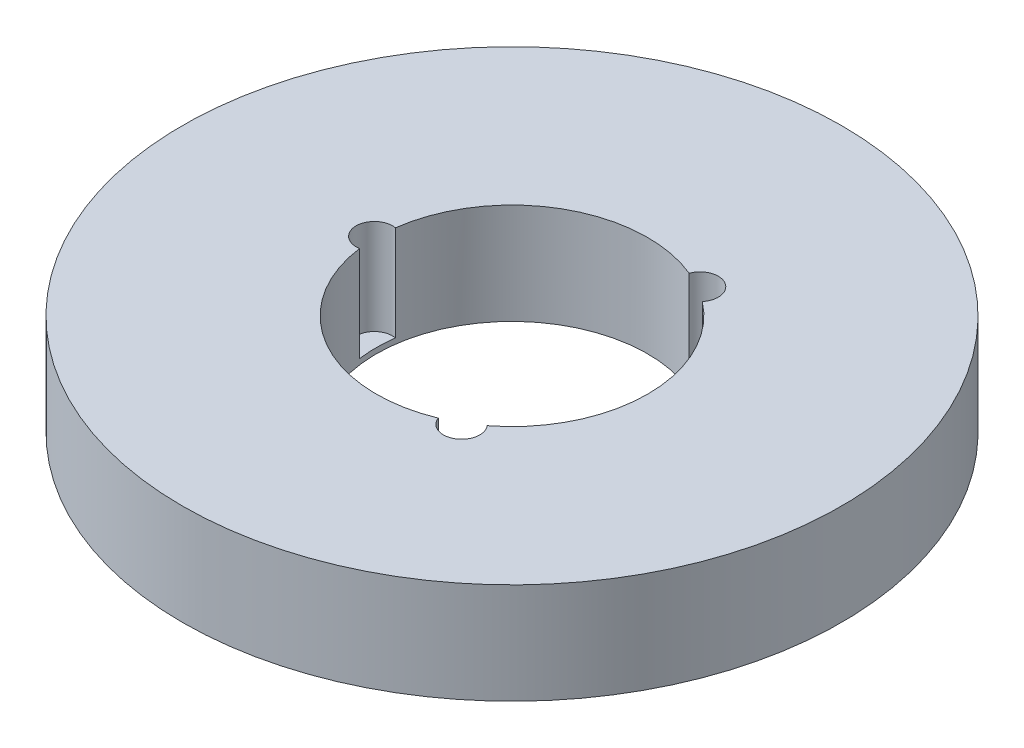
ISO-10303-21;
HEADER;
FILE_DESCRIPTION(('STEP AP214'),'2;1');
FILE_NAME('part.step','',(''),(''),'','','');
FILE_SCHEMA(('AUTOMOTIVE_DESIGN { 1 0 10303 214 1 1 1 1 }'));
ENDSEC;
DATA;
#1=APPLICATION_CONTEXT('core data for automotive mechanical design processes');
#2=APPLICATION_PROTOCOL_DEFINITION('international standard','automotive_design',2000,#1);
#3=PRODUCT_CONTEXT('',#1,'mechanical');
#4=PRODUCT('Part','Part','',(#3));
#5=PRODUCT_RELATED_PRODUCT_CATEGORY('part','',(#4));
#6=PRODUCT_DEFINITION_FORMATION('','',#4);
#7=PRODUCT_DEFINITION_CONTEXT('part definition',#1,'design');
#8=PRODUCT_DEFINITION('design','',#6,#7);
#9=PRODUCT_DEFINITION_SHAPE('','',#8);
#10=(LENGTH_UNIT() NAMED_UNIT(*) SI_UNIT(.MILLI.,.METRE.));
#11=(NAMED_UNIT(*) PLANE_ANGLE_UNIT() SI_UNIT($,.RADIAN.));
#12=(NAMED_UNIT(*) SI_UNIT($,.STERADIAN.) SOLID_ANGLE_UNIT());
#13=UNCERTAINTY_MEASURE_WITH_UNIT(LENGTH_MEASURE(1.E-05),#10,'distance_accuracy_value','');
#14=(GEOMETRIC_REPRESENTATION_CONTEXT(3) GLOBAL_UNCERTAINTY_ASSIGNED_CONTEXT((#13)) GLOBAL_UNIT_ASSIGNED_CONTEXT((#10,
#11,#12)) REPRESENTATION_CONTEXT('',''));
#15=CARTESIAN_POINT('',(0.,0.,0.));
#16=DIRECTION('',(0.,0.,1.));
#17=DIRECTION('',(1.,0.,0.));
#18=AXIS2_PLACEMENT_3D('',#15,#16,#17);
#19=CARTESIAN_POINT('',(0.,26.,0.));
#20=DIRECTION('',(0.,-1.,0.));
#21=DIRECTION('',(0.,0.,-1.));
#22=AXIS2_PLACEMENT_3D('',#19,#20,#21);
#23=CYLINDRICAL_SURFACE('',#22,85.);
#24=CARTESIAN_POINT('',(0.,26.,0.));
#25=DIRECTION('',(0.,1.,0.));
#26=DIRECTION('',(0.,0.,1.));
#27=AXIS2_PLACEMENT_3D('',#24,#25,#26);
#28=CIRCLE('',#27,85.);
#29=CARTESIAN_POINT('',(0.,26.,-85.));
#30=VERTEX_POINT('',#29);
#31=EDGE_CURVE('E126',#30,#30,#28,.T.);
#32=CARTESIAN_POINT('',(0.,0.,0.));
#33=DIRECTION('',(0.,1.,0.));
#34=DIRECTION('',(0.,0.,1.));
#35=AXIS2_PLACEMENT_3D('',#32,#33,#34);
#36=CIRCLE('',#35,85.);
#37=CARTESIAN_POINT('',(0.,0.,-85.));
#38=VERTEX_POINT('',#37);
#39=EDGE_CURVE('E124',#38,#38,#36,.T.);
#40=CARTESIAN_POINT('',(0.,26.,-85.));
#41=CARTESIAN_POINT('',(0.,25.7291666666667,-85.));
#42=CARTESIAN_POINT('',(0.,25.4583333333333,-85.));
#43=CARTESIAN_POINT('',(0.,24.9166666666667,-85.));
#44=CARTESIAN_POINT('',(0.,24.6458333333333,-85.));
#45=CARTESIAN_POINT('',(0.,24.1041666666667,-85.));
#46=CARTESIAN_POINT('',(0.,23.8333333333333,-85.));
#47=CARTESIAN_POINT('',(0.,23.2916666666667,-85.));
#48=CARTESIAN_POINT('',(0.,23.0208333333333,-85.));
#49=CARTESIAN_POINT('',(0.,22.4791666666667,-85.));
#50=CARTESIAN_POINT('',(0.,22.2083333333333,-85.));
#51=CARTESIAN_POINT('',(0.,21.6666666666667,-85.));
#52=CARTESIAN_POINT('',(0.,21.3958333333333,-85.));
#53=CARTESIAN_POINT('',(0.,20.8541666666667,-85.));
#54=CARTESIAN_POINT('',(0.,20.5833333333333,-85.));
#55=CARTESIAN_POINT('',(0.,20.0416666666667,-85.));
#56=CARTESIAN_POINT('',(0.,19.7708333333333,-85.));
#57=CARTESIAN_POINT('',(0.,19.2291666666667,-85.));
#58=CARTESIAN_POINT('',(0.,18.9583333333333,-85.));
#59=CARTESIAN_POINT('',(0.,18.4166666666667,-85.));
#60=CARTESIAN_POINT('',(0.,18.1458333333333,-85.));
#61=CARTESIAN_POINT('',(0.,17.6041666666667,-85.));
#62=CARTESIAN_POINT('',(0.,17.3333333333333,-85.));
#63=CARTESIAN_POINT('',(0.,16.7916666666667,-85.));
#64=CARTESIAN_POINT('',(0.,16.5208333333333,-85.));
#65=CARTESIAN_POINT('',(0.,15.9791666666667,-85.));
#66=CARTESIAN_POINT('',(0.,15.7083333333333,-85.));
#67=CARTESIAN_POINT('',(0.,15.1666666666667,-85.));
#68=CARTESIAN_POINT('',(0.,14.8958333333333,-85.));
#69=CARTESIAN_POINT('',(0.,14.3541666666667,-85.));
#70=CARTESIAN_POINT('',(0.,14.0833333333333,-85.));
#71=CARTESIAN_POINT('',(0.,13.5416666666667,-85.));
#72=CARTESIAN_POINT('',(0.,13.2708333333333,-85.));
#73=CARTESIAN_POINT('',(0.,12.7291666666667,-85.));
#74=CARTESIAN_POINT('',(0.,12.4583333333333,-85.));
#75=CARTESIAN_POINT('',(0.,11.9166666666667,-85.));
#76=CARTESIAN_POINT('',(0.,11.6458333333333,-85.));
#77=CARTESIAN_POINT('',(0.,11.1041666666667,-85.));
#78=CARTESIAN_POINT('',(0.,10.8333333333333,-85.));
#79=CARTESIAN_POINT('',(0.,10.2916666666667,-85.));
#80=CARTESIAN_POINT('',(0.,10.0208333333333,-85.));
#81=CARTESIAN_POINT('',(0.,9.47916666666667,-85.));
#82=CARTESIAN_POINT('',(0.,9.20833333333333,-85.));
#83=CARTESIAN_POINT('',(0.,8.66666666666667,-85.));
#84=CARTESIAN_POINT('',(0.,8.39583333333333,-85.));
#85=CARTESIAN_POINT('',(0.,7.85416666666667,-85.));
#86=CARTESIAN_POINT('',(0.,7.58333333333333,-85.));
#87=CARTESIAN_POINT('',(0.,7.04166666666667,-85.));
#88=CARTESIAN_POINT('',(0.,6.77083333333333,-85.));
#89=CARTESIAN_POINT('',(0.,6.22916666666667,-85.));
#90=CARTESIAN_POINT('',(0.,5.95833333333333,-85.));
#91=CARTESIAN_POINT('',(0.,5.41666666666667,-85.));
#92=CARTESIAN_POINT('',(0.,5.14583333333333,-85.));
#93=CARTESIAN_POINT('',(0.,4.60416666666667,-85.));
#94=CARTESIAN_POINT('',(0.,4.33333333333333,-85.));
#95=CARTESIAN_POINT('',(0.,3.79166666666667,-85.));
#96=CARTESIAN_POINT('',(0.,3.52083333333333,-85.));
#97=CARTESIAN_POINT('',(0.,2.97916666666667,-85.));
#98=CARTESIAN_POINT('',(0.,2.70833333333333,-85.));
#99=CARTESIAN_POINT('',(0.,2.16666666666667,-85.));
#100=CARTESIAN_POINT('',(0.,1.89583333333333,-85.));
#101=CARTESIAN_POINT('',(0.,1.35416666666667,-85.));
#102=CARTESIAN_POINT('',(0.,1.08333333333333,-85.));
#103=CARTESIAN_POINT('',(0.,0.541666666666667,-85.));
#104=CARTESIAN_POINT('',(0.,0.270833333333334,-85.));
#105=CARTESIAN_POINT('',(0.,0.,-85.));
#106=B_SPLINE_CURVE_WITH_KNOTS('',3,(#40,#41,#42,#43,#44,#45,#46,#47,#48,#49,#50,#51,#52,#53,
#54,#55,#56,#57,#58,#59,#60,#61,#62,#63,#64,#65,#66,#67,#68,#69,#70,#71,#72,#73,#74,#75,#76,#77,
#78,#79,#80,#81,#82,#83,#84,#85,#86,#87,#88,#89,#90,#91,#92,#93,#94,#95,#96,#97,#98,#99,#100,
#101,#102,#103,#104,#105),.UNSPECIFIED.,.F.,.F.,(4,2,2,2,2,2,2,2,2,2,2,2,2,2,2,2,2,2,2,2,2,2,2,
2,2,2,2,2,2,2,2,2,4),(0.,0.812500000000001,1.625,2.4375,3.25,4.0625,4.875,5.6875,6.5,7.3125,
8.125,8.9375,9.75,10.5625,11.375,12.1875,13.,13.8125,14.625,15.4375,16.25,17.0625,17.875,
18.6875,19.5,20.3125,21.125,21.9375,22.75,23.5625,24.375,25.1875,26.),.UNSPECIFIED.);
#107=EDGE_CURVE('BSEAM39',#30,#38,#106,.T.);
#108=ORIENTED_EDGE('',*,*,#31,.F.);
#109=ORIENTED_EDGE('',*,*,#39,.T.);
#110=ORIENTED_EDGE('',*,*,#107,.T.);
#111=ORIENTED_EDGE('',*,*,#107,.F.);
#112=EDGE_LOOP('',(#108,#110,#109,#111));
#113=FACE_BOUND('',#112,.T.);
#114=ADVANCED_FACE('F39',(#113),#23,.T.);
#115=CARTESIAN_POINT('',(0.,26.,0.));
#116=DIRECTION('',(0.,1.,0.));
#117=DIRECTION('',(0.,0.,1.));
#118=AXIS2_PLACEMENT_3D('',#115,#116,#117);
#119=PLANE('',#118);
#120=CARTESIAN_POINT('',(17.7537575044171,26.,30.7504100229073));
#121=DIRECTION('',(0.,1.,0.));
#122=DIRECTION('',(0.866025403784436,0.,-0.500000000000004));
#123=AXIS2_PLACEMENT_3D('',#120,#121,#122);
#124=CIRCLE('',#123,4.69683496182641);
#125=CARTESIAN_POINT('',(13.3405469255192,26.,32.3578399731506));
#126=VERTEX_POINT('',#125);
#127=CARTESIAN_POINT('',(21.3524379655806,26.,27.7321725244531));
#128=VERTEX_POINT('',#127);
#129=EDGE_CURVE('E147',#126,#128,#124,.T.);
#130=ORIENTED_EDGE('',*,*,#129,.F.);
#131=CARTESIAN_POINT('',(0.,26.,0.));
#132=DIRECTION('',(0.,1.,0.));
#133=DIRECTION('',(0.,0.,1.));
#134=AXIS2_PLACEMENT_3D('',#131,#132,#133);
#135=CIRCLE('',#134,35.);
#136=CARTESIAN_POINT('',(-34.6929848910996,26.,4.62566744869739));
#137=VERTEX_POINT('',#136);
#138=EDGE_CURVE('E118',#137,#126,#135,.T.);
#139=ORIENTED_EDGE('',*,*,#138,.F.);
#140=CARTESIAN_POINT('',(-35.5075150088339,26.,0.));
#141=DIRECTION('',(0.,1.,0.));
#142=DIRECTION('',(0.,0.,1.));
#143=AXIS2_PLACEMENT_3D('',#140,#141,#142);
#144=CIRCLE('',#143,4.69683496182641);
#145=CARTESIAN_POINT('',(-34.6929848910996,26.,-4.62566744869739));
#146=VERTEX_POINT('',#145);
#147=EDGE_CURVE('E113',#146,#137,#144,.T.);
#148=ORIENTED_EDGE('',*,*,#147,.F.);
#149=CARTESIAN_POINT('',(13.3405469255188,26.,-32.3578399731507));
#150=VERTEX_POINT('',#149);
#151=EDGE_CURVE('E106',#150,#146,#135,.T.);
#152=ORIENTED_EDGE('',*,*,#151,.F.);
#153=CARTESIAN_POINT('',(17.7537575044167,26.,-30.7504100229076));
#154=DIRECTION('',(0.,1.,0.));
#155=DIRECTION('',(-0.866025403784443,0.,-0.499999999999992));
#156=AXIS2_PLACEMENT_3D('',#153,#154,#155);
#157=CIRCLE('',#156,4.69683496182641);
#158=CARTESIAN_POINT('',(21.3524379655802,26.,-27.7321725244534));
#159=VERTEX_POINT('',#158);
#160=EDGE_CURVE('E90',#159,#150,#157,.T.);
#161=ORIENTED_EDGE('',*,*,#160,.F.);
#162=EDGE_CURVE('E116',#128,#159,#135,.T.);
#163=ORIENTED_EDGE('',*,*,#162,.F.);
#164=EDGE_LOOP('',(#130,#139,#148,#152,#161,#163));
#165=FACE_BOUND('',#164,.T.);
#166=ORIENTED_EDGE('',*,*,#31,.T.);
#167=EDGE_LOOP('',(#166));
#168=FACE_BOUND('',#167,.T.);
#169=ADVANCED_FACE('F115',(#165,#168),#119,.T.);
#170=CARTESIAN_POINT('',(0.,0.,0.));
#171=DIRECTION('',(0.,1.,0.));
#172=DIRECTION('',(0.,0.,1.));
#173=AXIS2_PLACEMENT_3D('',#170,#171,#172);
#174=PLANE('',#173);
#175=CARTESIAN_POINT('',(0.,0.,0.));
#176=DIRECTION('',(0.,1.,0.));
#177=DIRECTION('',(0.,0.,1.));
#178=AXIS2_PLACEMENT_3D('',#175,#176,#177);
#179=CIRCLE('',#178,35.);
#180=CARTESIAN_POINT('',(0.,0.,35.));
#181=VERTEX_POINT('',#180);
#182=EDGE_CURVE('E120',#181,#181,#179,.T.);
#183=ORIENTED_EDGE('',*,*,#182,.T.);
#184=EDGE_LOOP('',(#183));
#185=FACE_BOUND('',#184,.T.);
#186=ORIENTED_EDGE('',*,*,#39,.F.);
#187=EDGE_LOOP('',(#186));
#188=FACE_BOUND('',#187,.T.);
#189=ADVANCED_FACE('F164',(#185,#188),#174,.F.);
#190=CARTESIAN_POINT('',(0.,26.,0.));
#191=DIRECTION('',(0.,-1.,0.));
#192=DIRECTION('',(0.,0.,-1.));
#193=AXIS2_PLACEMENT_3D('',#190,#191,#192);
#194=CYLINDRICAL_SURFACE('',#193,35.);
#195=DIRECTION('',(0.,1.,0.));
#196=VECTOR('',#195,1.);
#197=CARTESIAN_POINT('',(13.3405469255192,13.7049711812287,32.3578399731506));
#198=LINE('',#197,#196);
#199=CARTESIAN_POINT('',(13.3405469255192,1.40994236245748,32.3578399731506));
#200=VERTEX_POINT('',#199);
#201=EDGE_CURVE('E11',#200,#126,#198,.T.);
#202=ORIENTED_EDGE('',*,*,#201,.F.);
#203=CARTESIAN_POINT('',(0.,1.40994236245748,0.));
#204=DIRECTION('',(0.,1.,0.));
#205=DIRECTION('',(0.,0.,1.));
#206=AXIS2_PLACEMENT_3D('',#203,#204,#205);
#207=CIRCLE('',#206,35.);
#208=CARTESIAN_POINT('',(21.3524379655806,1.40994236245748,27.7321725244531));
#209=VERTEX_POINT('',#208);
#210=EDGE_CURVE('E144',#200,#209,#207,.T.);
#211=ORIENTED_EDGE('',*,*,#210,.T.);
#212=DIRECTION('',(0.,1.,0.));
#213=VECTOR('',#212,1.);
#214=CARTESIAN_POINT('',(21.3524379655806,13.7049711812287,27.7321725244531));
#215=LINE('',#214,#213);
#216=EDGE_CURVE('E46',#128,#209,#215,.F.);
#217=ORIENTED_EDGE('',*,*,#216,.F.);
#218=ORIENTED_EDGE('',*,*,#162,.T.);
#219=DIRECTION('',(0.,1.,0.));
#220=VECTOR('',#219,1.);
#221=CARTESIAN_POINT('',(21.3524379655802,13.7049711812287,-27.7321725244534));
#222=LINE('',#221,#220);
#223=CARTESIAN_POINT('',(21.3524379655802,1.40994236245748,-27.7321725244534));
#224=VERTEX_POINT('',#223);
#225=EDGE_CURVE('E92',#224,#159,#222,.T.);
#226=ORIENTED_EDGE('',*,*,#225,.F.);
#227=CARTESIAN_POINT('',(0.,1.40994236245748,0.));
#228=DIRECTION('',(0.,1.,0.));
#229=DIRECTION('',(0.,0.,1.));
#230=AXIS2_PLACEMENT_3D('',#227,#228,#229);
#231=CIRCLE('',#230,35.);
#232=CARTESIAN_POINT('',(13.3405469255188,1.40994236245748,-32.3578399731507));
#233=VERTEX_POINT('',#232);
#234=EDGE_CURVE('E107',#224,#233,#231,.T.);
#235=ORIENTED_EDGE('',*,*,#234,.T.);
#236=DIRECTION('',(0.,1.,0.));
#237=VECTOR('',#236,1.);
#238=CARTESIAN_POINT('',(13.3405469255188,13.7049711812287,-32.3578399731507));
#239=LINE('',#238,#237);
#240=EDGE_CURVE('E95',#150,#233,#239,.F.);
#241=ORIENTED_EDGE('',*,*,#240,.F.);
#242=ORIENTED_EDGE('',*,*,#151,.T.);
#243=DIRECTION('',(0.,1.,0.));
#244=VECTOR('',#243,1.);
#245=CARTESIAN_POINT('',(-34.6929848910995,13.7049711812287,-4.62566744869739));
#246=LINE('',#245,#244);
#247=CARTESIAN_POINT('',(-34.6929848910996,1.40994236245748,-4.62566744869739));
#248=VERTEX_POINT('',#247);
#249=EDGE_CURVE('E143',#248,#146,#246,.T.);
#250=ORIENTED_EDGE('',*,*,#249,.F.);
#251=CARTESIAN_POINT('',(0.,1.40994236245748,0.));
#252=DIRECTION('',(0.,1.,0.));
#253=DIRECTION('',(0.,0.,1.));
#254=AXIS2_PLACEMENT_3D('',#251,#252,#253);
#255=CIRCLE('',#254,35.);
#256=CARTESIAN_POINT('',(-34.6929848910996,1.40994236245748,4.62566744869739));
#257=VERTEX_POINT('',#256);
#258=EDGE_CURVE('E132',#248,#257,#255,.T.);
#259=ORIENTED_EDGE('',*,*,#258,.T.);
#260=DIRECTION('',(0.,1.,0.));
#261=VECTOR('',#260,1.);
#262=CARTESIAN_POINT('',(-34.6929848910995,13.7049711812287,4.62566744869739));
#263=LINE('',#262,#261);
#264=EDGE_CURVE('E137',#137,#257,#263,.F.);
#265=ORIENTED_EDGE('',*,*,#264,.F.);
#266=ORIENTED_EDGE('',*,*,#138,.T.);
#267=EDGE_LOOP('',(#202,#211,#217,#218,#226,#235,#241,#242,#250,#259,#265,#266));
#268=FACE_BOUND('',#267,.T.);
#269=ORIENTED_EDGE('',*,*,#182,.F.);
#270=EDGE_LOOP('',(#269));
#271=FACE_BOUND('',#270,.T.);
#272=ADVANCED_FACE('F103',(#268,#271),#194,.F.);
#273=CARTESIAN_POINT('',(-35.5075150088339,1.40994236245748,0.));
#274=DIRECTION('',(0.,1.,0.));
#275=DIRECTION('',(0.,0.,1.));
#276=AXIS2_PLACEMENT_3D('',#273,#274,#275);
#277=CYLINDRICAL_SURFACE('',#276,4.69683496182641);
#278=ORIENTED_EDGE('',*,*,#249,.T.);
#279=ORIENTED_EDGE('',*,*,#147,.T.);
#280=ORIENTED_EDGE('',*,*,#264,.T.);
#281=CARTESIAN_POINT('',(-35.5075150088339,1.40994236245748,0.));
#282=DIRECTION('',(0.,1.,0.));
#283=DIRECTION('',(0.,0.,1.));
#284=AXIS2_PLACEMENT_3D('',#281,#282,#283);
#285=CIRCLE('',#284,4.69683496182641);
#286=EDGE_CURVE('E121',#248,#257,#285,.T.);
#287=ORIENTED_EDGE('',*,*,#286,.F.);
#288=EDGE_LOOP('',(#278,#279,#280,#287));
#289=FACE_BOUND('',#288,.T.);
#290=ADVANCED_FACE('F174',(#289),#277,.F.);
#291=CARTESIAN_POINT('',(-35.5075150088339,1.40994236245748,0.));
#292=DIRECTION('',(0.,1.,0.));
#293=DIRECTION('',(0.,0.,1.));
#294=AXIS2_PLACEMENT_3D('',#291,#292,#293);
#295=PLANE('',#294);
#296=ORIENTED_EDGE('',*,*,#286,.T.);
#297=ORIENTED_EDGE('',*,*,#258,.F.);
#298=EDGE_LOOP('',(#296,#297));
#299=FACE_BOUND('',#298,.T.);
#300=ADVANCED_FACE('F177',(#299),#295,.T.);
#301=CARTESIAN_POINT('',(17.7537575044167,1.40994236245748,-30.7504100229076));
#302=DIRECTION('',(0.,1.,0.));
#303=DIRECTION('',(0.,0.,1.));
#304=AXIS2_PLACEMENT_3D('',#301,#302,#303);
#305=CYLINDRICAL_SURFACE('',#304,4.69683496182641);
#306=ORIENTED_EDGE('',*,*,#225,.T.);
#307=ORIENTED_EDGE('',*,*,#160,.T.);
#308=ORIENTED_EDGE('',*,*,#240,.T.);
#309=CARTESIAN_POINT('',(17.7537575044167,1.40994236245748,-30.7504100229076));
#310=DIRECTION('',(0.,1.,0.));
#311=DIRECTION('',(-0.866025403784443,0.,-0.499999999999992));
#312=AXIS2_PLACEMENT_3D('',#309,#310,#311);
#313=CIRCLE('',#312,4.69683496182641);
#314=EDGE_CURVE('E56',#224,#233,#313,.T.);
#315=ORIENTED_EDGE('',*,*,#314,.F.);
#316=EDGE_LOOP('',(#306,#307,#308,#315));
#317=FACE_BOUND('',#316,.T.);
#318=ADVANCED_FACE('F93',(#317),#305,.F.);
#319=CARTESIAN_POINT('',(17.7537575044167,1.40994236245748,-30.7504100229076));
#320=DIRECTION('',(0.,1.,0.));
#321=DIRECTION('',(-0.866025403784443,0.,-0.499999999999992));
#322=AXIS2_PLACEMENT_3D('',#319,#320,#321);
#323=PLANE('',#322);
#324=ORIENTED_EDGE('',*,*,#314,.T.);
#325=ORIENTED_EDGE('',*,*,#234,.F.);
#326=EDGE_LOOP('',(#324,#325));
#327=FACE_BOUND('',#326,.T.);
#328=ADVANCED_FACE('F160',(#327),#323,.T.);
#329=CARTESIAN_POINT('',(17.7537575044171,1.40994236245748,30.7504100229073));
#330=DIRECTION('',(0.,1.,0.));
#331=DIRECTION('',(0.,0.,1.));
#332=AXIS2_PLACEMENT_3D('',#329,#330,#331);
#333=CYLINDRICAL_SURFACE('',#332,4.69683496182641);
#334=ORIENTED_EDGE('',*,*,#201,.T.);
#335=ORIENTED_EDGE('',*,*,#129,.T.);
#336=ORIENTED_EDGE('',*,*,#216,.T.);
#337=CARTESIAN_POINT('',(17.7537575044171,1.40994236245748,30.7504100229073));
#338=DIRECTION('',(0.,1.,0.));
#339=DIRECTION('',(0.866025403784436,0.,-0.500000000000004));
#340=AXIS2_PLACEMENT_3D('',#337,#338,#339);
#341=CIRCLE('',#340,4.69683496182641);
#342=EDGE_CURVE('E55',#200,#209,#341,.T.);
#343=ORIENTED_EDGE('',*,*,#342,.F.);
#344=EDGE_LOOP('',(#334,#335,#336,#343));
#345=FACE_BOUND('',#344,.T.);
#346=ADVANCED_FACE('F149',(#345),#333,.F.);
#347=CARTESIAN_POINT('',(17.7537575044171,1.40994236245748,30.7504100229073));
#348=DIRECTION('',(0.,1.,0.));
#349=DIRECTION('',(0.866025403784436,0.,-0.500000000000004));
#350=AXIS2_PLACEMENT_3D('',#347,#348,#349);
#351=PLANE('',#350);
#352=ORIENTED_EDGE('',*,*,#342,.T.);
#353=ORIENTED_EDGE('',*,*,#210,.F.);
#354=EDGE_LOOP('',(#352,#353));
#355=FACE_BOUND('',#354,.T.);
#356=ADVANCED_FACE('F151',(#355),#351,.T.);
#357=CLOSED_SHELL('',(#114,#169,#189,#272,#290,#300,#318,#328,#346,#356));
#358=MANIFOLD_SOLID_BREP('B2',#357);
#359=ADVANCED_BREP_SHAPE_REPRESENTATION('',(#18,#358),#14);
#360=SHAPE_DEFINITION_REPRESENTATION(#9,#359);
ENDSEC;
END-ISO-10303-21;
